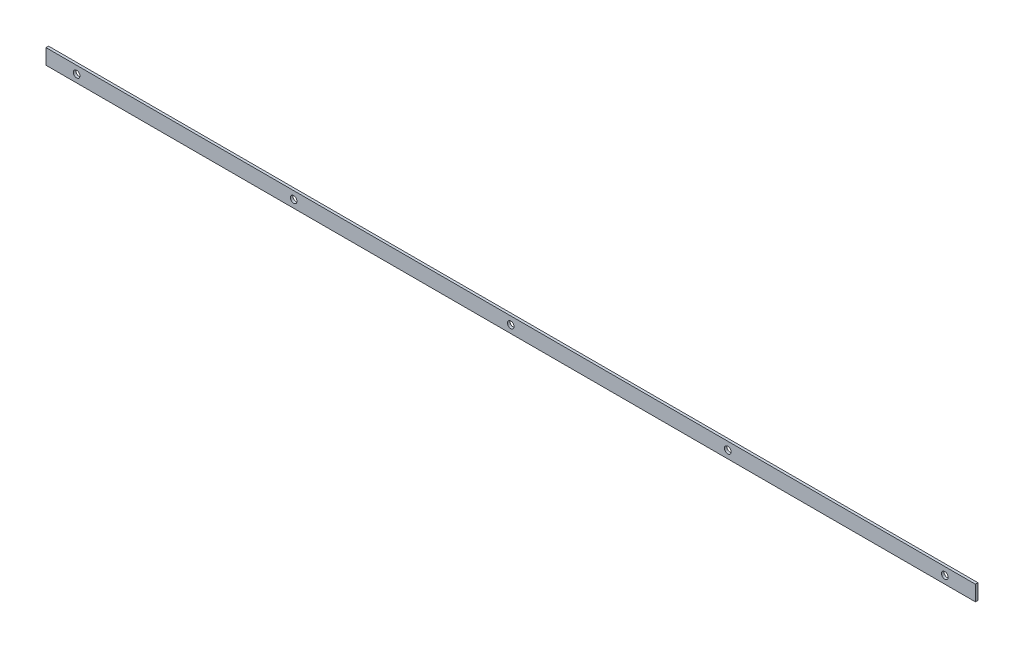
ISO-10303-21;
HEADER;
FILE_DESCRIPTION(('STEP AP214'),'2;1');
FILE_NAME('part.step','',(''),(''),'','','');
FILE_SCHEMA(('AUTOMOTIVE_DESIGN { 1 0 10303 214 1 1 1 1 }'));
ENDSEC;
DATA;
#1=APPLICATION_CONTEXT('core data for automotive mechanical design processes');
#2=APPLICATION_PROTOCOL_DEFINITION('international standard','automotive_design',2000,#1);
#3=PRODUCT_CONTEXT('',#1,'mechanical');
#4=PRODUCT('Part','Part','',(#3));
#5=PRODUCT_RELATED_PRODUCT_CATEGORY('part','',(#4));
#6=PRODUCT_DEFINITION_FORMATION('','',#4);
#7=PRODUCT_DEFINITION_CONTEXT('part definition',#1,'design');
#8=PRODUCT_DEFINITION('design','',#6,#7);
#9=PRODUCT_DEFINITION_SHAPE('','',#8);
#10=(LENGTH_UNIT() NAMED_UNIT(*) SI_UNIT(.MILLI.,.METRE.));
#11=(NAMED_UNIT(*) PLANE_ANGLE_UNIT() SI_UNIT($,.RADIAN.));
#12=(NAMED_UNIT(*) SI_UNIT($,.STERADIAN.) SOLID_ANGLE_UNIT());
#13=UNCERTAINTY_MEASURE_WITH_UNIT(LENGTH_MEASURE(1.E-05),#10,'distance_accuracy_value','');
#14=(GEOMETRIC_REPRESENTATION_CONTEXT(3) GLOBAL_UNCERTAINTY_ASSIGNED_CONTEXT((#13)) GLOBAL_UNIT_ASSIGNED_CONTEXT((#10,
#11,#12)) REPRESENTATION_CONTEXT('',''));
#15=CARTESIAN_POINT('',(0.,0.,0.));
#16=DIRECTION('',(0.,0.,1.));
#17=DIRECTION('',(1.,0.,0.));
#18=AXIS2_PLACEMENT_3D('',#15,#16,#17);
#19=CARTESIAN_POINT('',(850.,0.,-2.5));
#20=DIRECTION('',(0.,0.,-1.));
#21=DIRECTION('',(-1.,0.,0.));
#22=AXIS2_PLACEMENT_3D('',#19,#20,#21);
#23=CYLINDRICAL_SURFACE('',#22,6.49999999999995);
#24=CARTESIAN_POINT('',(850.,0.,2.5));
#25=DIRECTION('',(0.,0.,-1.));
#26=DIRECTION('',(-1.,0.,0.));
#27=AXIS2_PLACEMENT_3D('',#24,#25,#26);
#28=CIRCLE('',#27,6.49999999999995);
#29=CARTESIAN_POINT('',(843.5,0.,2.5));
#30=VERTEX_POINT('',#29);
#31=EDGE_CURVE('E57',#30,#30,#28,.T.);
#32=ORIENTED_EDGE('',*,*,#31,.F.);
#33=EDGE_LOOP('',(#32));
#34=FACE_BOUND('',#33,.T.);
#35=CARTESIAN_POINT('',(850.,0.,-2.5));
#36=DIRECTION('',(0.,0.,-1.));
#37=DIRECTION('',(-1.,0.,0.));
#38=AXIS2_PLACEMENT_3D('',#35,#36,#37);
#39=CIRCLE('',#38,6.49999999999995);
#40=CARTESIAN_POINT('',(843.5,0.,-2.5));
#41=VERTEX_POINT('',#40);
#42=EDGE_CURVE('E12',#41,#41,#39,.T.);
#43=ORIENTED_EDGE('',*,*,#42,.T.);
#44=EDGE_LOOP('',(#43));
#45=FACE_BOUND('',#44,.T.);
#46=ADVANCED_FACE('F49',(#34,#45),#23,.F.);
#47=CARTESIAN_POINT('',(425.,0.,-2.5));
#48=DIRECTION('',(0.,0.,-1.));
#49=DIRECTION('',(-1.,0.,0.));
#50=AXIS2_PLACEMENT_3D('',#47,#48,#49);
#51=CYLINDRICAL_SURFACE('',#50,6.49999999999995);
#52=CARTESIAN_POINT('',(425.,0.,2.5));
#53=DIRECTION('',(0.,0.,-1.));
#54=DIRECTION('',(-1.,0.,0.));
#55=AXIS2_PLACEMENT_3D('',#52,#53,#54);
#56=CIRCLE('',#55,6.49999999999995);
#57=CARTESIAN_POINT('',(418.5,0.,2.5));
#58=VERTEX_POINT('',#57);
#59=EDGE_CURVE('E133',#58,#58,#56,.T.);
#60=ORIENTED_EDGE('',*,*,#59,.F.);
#61=EDGE_LOOP('',(#60));
#62=FACE_BOUND('',#61,.T.);
#63=CARTESIAN_POINT('',(425.,0.,-2.5));
#64=DIRECTION('',(0.,0.,-1.));
#65=DIRECTION('',(-1.,0.,0.));
#66=AXIS2_PLACEMENT_3D('',#63,#64,#65);
#67=CIRCLE('',#66,6.49999999999995);
#68=CARTESIAN_POINT('',(418.5,0.,-2.5));
#69=VERTEX_POINT('',#68);
#70=EDGE_CURVE('E136',#69,#69,#67,.T.);
#71=ORIENTED_EDGE('',*,*,#70,.T.);
#72=EDGE_LOOP('',(#71));
#73=FACE_BOUND('',#72,.T.);
#74=ADVANCED_FACE('F145',(#62,#73),#51,.F.);
#75=CARTESIAN_POINT('',(0.,0.,-2.5));
#76=DIRECTION('',(0.,0.,-1.));
#77=DIRECTION('',(-1.,0.,0.));
#78=AXIS2_PLACEMENT_3D('',#75,#76,#77);
#79=CYLINDRICAL_SURFACE('',#78,6.49999999999995);
#80=CARTESIAN_POINT('',(0.,0.,2.5));
#81=DIRECTION('',(0.,0.,-1.));
#82=DIRECTION('',(-1.,0.,0.));
#83=AXIS2_PLACEMENT_3D('',#80,#81,#82);
#84=CIRCLE('',#83,6.49999999999995);
#85=CARTESIAN_POINT('',(-6.49999999999995,0.,2.5));
#86=VERTEX_POINT('',#85);
#87=EDGE_CURVE('E127',#86,#86,#84,.T.);
#88=ORIENTED_EDGE('',*,*,#87,.F.);
#89=EDGE_LOOP('',(#88));
#90=FACE_BOUND('',#89,.T.);
#91=CARTESIAN_POINT('',(0.,0.,-2.5));
#92=DIRECTION('',(0.,0.,-1.));
#93=DIRECTION('',(-1.,0.,0.));
#94=AXIS2_PLACEMENT_3D('',#91,#92,#93);
#95=CIRCLE('',#94,6.49999999999995);
#96=CARTESIAN_POINT('',(-6.49999999999995,0.,-2.5));
#97=VERTEX_POINT('',#96);
#98=EDGE_CURVE('E130',#97,#97,#95,.T.);
#99=ORIENTED_EDGE('',*,*,#98,.T.);
#100=EDGE_LOOP('',(#99));
#101=FACE_BOUND('',#100,.T.);
#102=ADVANCED_FACE('F157',(#90,#101),#79,.F.);
#103=CARTESIAN_POINT('',(910.,-15.,2.5));
#104=DIRECTION('',(0.,1.,0.));
#105=DIRECTION('',(0.,0.,1.));
#106=AXIS2_PLACEMENT_3D('',#103,#104,#105);
#107=PLANE('',#106);
#108=DIRECTION('',(0.,0.,-1.));
#109=VECTOR('',#108,1.);
#110=CARTESIAN_POINT('',(-910.,-15.,2.5));
#111=LINE('',#110,#109);
#112=CARTESIAN_POINT('',(-910.,-15.,2.5));
#113=VERTEX_POINT('',#112);
#114=CARTESIAN_POINT('',(-910.,-15.,-2.5));
#115=VERTEX_POINT('',#114);
#116=EDGE_CURVE('E117',#113,#115,#111,.T.);
#117=ORIENTED_EDGE('',*,*,#116,.T.);
#118=DIRECTION('',(-1.,0.,0.));
#119=VECTOR('',#118,1.);
#120=CARTESIAN_POINT('',(910.,-15.,-2.5));
#121=LINE('',#120,#119);
#122=CARTESIAN_POINT('',(910.,-15.,-2.5));
#123=VERTEX_POINT('',#122);
#124=EDGE_CURVE('E108',#123,#115,#121,.T.);
#125=ORIENTED_EDGE('',*,*,#124,.F.);
#126=DIRECTION('',(0.,0.,-1.));
#127=VECTOR('',#126,1.);
#128=CARTESIAN_POINT('',(910.,-15.,2.5));
#129=LINE('',#128,#127);
#130=CARTESIAN_POINT('',(910.,-15.,2.5));
#131=VERTEX_POINT('',#130);
#132=EDGE_CURVE('E101',#131,#123,#129,.T.);
#133=ORIENTED_EDGE('',*,*,#132,.F.);
#134=DIRECTION('',(-1.,0.,0.));
#135=VECTOR('',#134,1.);
#136=CARTESIAN_POINT('',(910.,-15.,2.5));
#137=LINE('',#136,#135);
#138=EDGE_CURVE('E113',#131,#113,#137,.T.);
#139=ORIENTED_EDGE('',*,*,#138,.T.);
#140=EDGE_LOOP('',(#117,#125,#133,#139));
#141=FACE_BOUND('',#140,.T.);
#142=ADVANCED_FACE('F149',(#141),#107,.F.);
#143=CARTESIAN_POINT('',(910.,-15.,-2.5));
#144=DIRECTION('',(0.,0.,1.));
#145=DIRECTION('',(1.,0.,0.));
#146=AXIS2_PLACEMENT_3D('',#143,#144,#145);
#147=PLANE('',#146);
#148=CARTESIAN_POINT('',(-425.,0.,-2.5));
#149=DIRECTION('',(0.,0.,-1.));
#150=DIRECTION('',(-1.,0.,0.));
#151=AXIS2_PLACEMENT_3D('',#148,#149,#150);
#152=CIRCLE('',#151,6.49999999999995);
#153=CARTESIAN_POINT('',(-431.5,0.,-2.5));
#154=VERTEX_POINT('',#153);
#155=EDGE_CURVE('E201',#154,#154,#152,.T.);
#156=ORIENTED_EDGE('',*,*,#155,.F.);
#157=EDGE_LOOP('',(#156));
#158=FACE_BOUND('',#157,.T.);
#159=CARTESIAN_POINT('',(-850.,0.,-2.5));
#160=DIRECTION('',(0.,0.,-1.));
#161=DIRECTION('',(-1.,0.,0.));
#162=AXIS2_PLACEMENT_3D('',#159,#160,#161);
#163=CIRCLE('',#162,6.49999999999995);
#164=CARTESIAN_POINT('',(-856.5,0.,-2.5));
#165=VERTEX_POINT('',#164);
#166=EDGE_CURVE('E202',#165,#165,#163,.T.);
#167=ORIENTED_EDGE('',*,*,#166,.F.);
#168=EDGE_LOOP('',(#167));
#169=FACE_BOUND('',#168,.T.);
#170=DIRECTION('',(0.,1.,0.));
#171=VECTOR('',#170,1.);
#172=CARTESIAN_POINT('',(-910.,-15.,-2.5));
#173=LINE('',#172,#171);
#174=CARTESIAN_POINT('',(-910.,15.,-2.5));
#175=VERTEX_POINT('',#174);
#176=EDGE_CURVE('E107',#115,#175,#173,.T.);
#177=ORIENTED_EDGE('',*,*,#176,.T.);
#178=DIRECTION('',(-1.,0.,0.));
#179=VECTOR('',#178,1.);
#180=CARTESIAN_POINT('',(910.,15.,-2.5));
#181=LINE('',#180,#179);
#182=CARTESIAN_POINT('',(910.,15.,-2.5));
#183=VERTEX_POINT('',#182);
#184=EDGE_CURVE('E104',#183,#175,#181,.T.);
#185=ORIENTED_EDGE('',*,*,#184,.F.);
#186=DIRECTION('',(0.,1.,0.));
#187=VECTOR('',#186,1.);
#188=CARTESIAN_POINT('',(910.,-15.,-2.5));
#189=LINE('',#188,#187);
#190=EDGE_CURVE('E96',#123,#183,#189,.T.);
#191=ORIENTED_EDGE('',*,*,#190,.F.);
#192=ORIENTED_EDGE('',*,*,#124,.T.);
#193=EDGE_LOOP('',(#177,#185,#191,#192));
#194=FACE_BOUND('',#193,.T.);
#195=ORIENTED_EDGE('',*,*,#98,.F.);
#196=EDGE_LOOP('',(#195));
#197=FACE_BOUND('',#196,.T.);
#198=ORIENTED_EDGE('',*,*,#70,.F.);
#199=EDGE_LOOP('',(#198));
#200=FACE_BOUND('',#199,.T.);
#201=ORIENTED_EDGE('',*,*,#42,.F.);
#202=EDGE_LOOP('',(#201));
#203=FACE_BOUND('',#202,.T.);
#204=ADVANCED_FACE('F105',(#158,#169,#194,#197,#200,#203),#147,.F.);
#205=CARTESIAN_POINT('',(910.,15.,2.5));
#206=DIRECTION('',(0.,-1.,0.));
#207=DIRECTION('',(0.,0.,-1.));
#208=AXIS2_PLACEMENT_3D('',#205,#206,#207);
#209=PLANE('',#208);
#210=DIRECTION('',(0.,0.,1.));
#211=VECTOR('',#210,1.);
#212=CARTESIAN_POINT('',(-910.,15.,2.5));
#213=LINE('',#212,#211);
#214=CARTESIAN_POINT('',(-910.,15.,2.5));
#215=VERTEX_POINT('',#214);
#216=EDGE_CURVE('E82',#175,#215,#213,.T.);
#217=ORIENTED_EDGE('',*,*,#216,.T.);
#218=DIRECTION('',(-1.,0.,0.));
#219=VECTOR('',#218,1.);
#220=CARTESIAN_POINT('',(910.,15.,2.5));
#221=LINE('',#220,#219);
#222=CARTESIAN_POINT('',(910.,15.,2.5));
#223=VERTEX_POINT('',#222);
#224=EDGE_CURVE('E109',#223,#215,#221,.T.);
#225=ORIENTED_EDGE('',*,*,#224,.F.);
#226=DIRECTION('',(0.,0.,1.));
#227=VECTOR('',#226,1.);
#228=CARTESIAN_POINT('',(910.,15.,2.5));
#229=LINE('',#228,#227);
#230=EDGE_CURVE('E99',#183,#223,#229,.T.);
#231=ORIENTED_EDGE('',*,*,#230,.F.);
#232=ORIENTED_EDGE('',*,*,#184,.T.);
#233=EDGE_LOOP('',(#217,#225,#231,#232));
#234=FACE_BOUND('',#233,.T.);
#235=ADVANCED_FACE('F111',(#234),#209,.F.);
#236=CARTESIAN_POINT('',(910.,-15.,2.5));
#237=DIRECTION('',(0.,0.,-1.));
#238=DIRECTION('',(-1.,0.,0.));
#239=AXIS2_PLACEMENT_3D('',#236,#237,#238);
#240=PLANE('',#239);
#241=CARTESIAN_POINT('',(-425.,0.,2.5));
#242=DIRECTION('',(0.,0.,-1.));
#243=DIRECTION('',(-1.,0.,0.));
#244=AXIS2_PLACEMENT_3D('',#241,#242,#243);
#245=CIRCLE('',#244,6.49999999999995);
#246=CARTESIAN_POINT('',(-431.5,0.,2.5));
#247=VERTEX_POINT('',#246);
#248=EDGE_CURVE('E199',#247,#247,#245,.T.);
#249=ORIENTED_EDGE('',*,*,#248,.T.);
#250=EDGE_LOOP('',(#249));
#251=FACE_BOUND('',#250,.T.);
#252=CARTESIAN_POINT('',(-850.,0.,2.5));
#253=DIRECTION('',(0.,0.,-1.));
#254=DIRECTION('',(-1.,0.,0.));
#255=AXIS2_PLACEMENT_3D('',#252,#253,#254);
#256=CIRCLE('',#255,6.49999999999995);
#257=CARTESIAN_POINT('',(-856.5,0.,2.5));
#258=VERTEX_POINT('',#257);
#259=EDGE_CURVE('E120',#258,#258,#256,.T.);
#260=ORIENTED_EDGE('',*,*,#259,.T.);
#261=EDGE_LOOP('',(#260));
#262=FACE_BOUND('',#261,.T.);
#263=DIRECTION('',(0.,-1.,0.));
#264=VECTOR('',#263,1.);
#265=CARTESIAN_POINT('',(-910.,-15.,2.5));
#266=LINE('',#265,#264);
#267=EDGE_CURVE('E88',#215,#113,#266,.T.);
#268=ORIENTED_EDGE('',*,*,#267,.T.);
#269=ORIENTED_EDGE('',*,*,#138,.F.);
#270=DIRECTION('',(0.,-1.,0.));
#271=VECTOR('',#270,1.);
#272=CARTESIAN_POINT('',(910.,-15.,2.5));
#273=LINE('',#272,#271);
#274=EDGE_CURVE('E65',#223,#131,#273,.T.);
#275=ORIENTED_EDGE('',*,*,#274,.F.);
#276=ORIENTED_EDGE('',*,*,#224,.T.);
#277=EDGE_LOOP('',(#268,#269,#275,#276));
#278=FACE_BOUND('',#277,.T.);
#279=ORIENTED_EDGE('',*,*,#87,.T.);
#280=EDGE_LOOP('',(#279));
#281=FACE_BOUND('',#280,.T.);
#282=ORIENTED_EDGE('',*,*,#59,.T.);
#283=EDGE_LOOP('',(#282));
#284=FACE_BOUND('',#283,.T.);
#285=ORIENTED_EDGE('',*,*,#31,.T.);
#286=EDGE_LOOP('',(#285));
#287=FACE_BOUND('',#286,.T.);
#288=ADVANCED_FACE('F141',(#251,#262,#278,#281,#284,#287),#240,.F.);
#289=CARTESIAN_POINT('',(910.,-15.,-2.5));
#290=DIRECTION('',(1.,0.,0.));
#291=DIRECTION('',(0.,0.,-1.));
#292=AXIS2_PLACEMENT_3D('',#289,#290,#291);
#293=PLANE('',#292);
#294=ORIENTED_EDGE('',*,*,#132,.T.);
#295=ORIENTED_EDGE('',*,*,#190,.T.);
#296=ORIENTED_EDGE('',*,*,#230,.T.);
#297=ORIENTED_EDGE('',*,*,#274,.T.);
#298=EDGE_LOOP('',(#294,#295,#296,#297));
#299=FACE_BOUND('',#298,.T.);
#300=ADVANCED_FACE('F97',(#299),#293,.T.);
#301=CARTESIAN_POINT('',(-910.,-15.,-2.5));
#302=DIRECTION('',(1.,0.,0.));
#303=DIRECTION('',(0.,0.,-1.));
#304=AXIS2_PLACEMENT_3D('',#301,#302,#303);
#305=PLANE('',#304);
#306=ORIENTED_EDGE('',*,*,#116,.F.);
#307=ORIENTED_EDGE('',*,*,#267,.F.);
#308=ORIENTED_EDGE('',*,*,#216,.F.);
#309=ORIENTED_EDGE('',*,*,#176,.F.);
#310=EDGE_LOOP('',(#306,#307,#308,#309));
#311=FACE_BOUND('',#310,.T.);
#312=ADVANCED_FACE('F180',(#311),#305,.F.);
#313=CARTESIAN_POINT('',(-850.,0.,-2.5));
#314=DIRECTION('',(0.,0.,-1.));
#315=DIRECTION('',(-1.,0.,0.));
#316=AXIS2_PLACEMENT_3D('',#313,#314,#315);
#317=CYLINDRICAL_SURFACE('',#316,6.49999999999995);
#318=ORIENTED_EDGE('',*,*,#259,.F.);
#319=EDGE_LOOP('',(#318));
#320=FACE_BOUND('',#319,.T.);
#321=ORIENTED_EDGE('',*,*,#166,.T.);
#322=EDGE_LOOP('',(#321));
#323=FACE_BOUND('',#322,.T.);
#324=ADVANCED_FACE('F186',(#320,#323),#317,.F.);
#325=CARTESIAN_POINT('',(-425.,0.,-2.5));
#326=DIRECTION('',(0.,0.,-1.));
#327=DIRECTION('',(-1.,0.,0.));
#328=AXIS2_PLACEMENT_3D('',#325,#326,#327);
#329=CYLINDRICAL_SURFACE('',#328,6.49999999999995);
#330=ORIENTED_EDGE('',*,*,#248,.F.);
#331=EDGE_LOOP('',(#330));
#332=FACE_BOUND('',#331,.T.);
#333=ORIENTED_EDGE('',*,*,#155,.T.);
#334=EDGE_LOOP('',(#333));
#335=FACE_BOUND('',#334,.T.);
#336=ADVANCED_FACE('F191',(#332,#335),#329,.F.);
#337=CLOSED_SHELL('',(#46,#74,#102,#142,#204,#235,#288,#300,#312,#324,#336));
#338=MANIFOLD_SOLID_BREP('B2',#337);
#339=ADVANCED_BREP_SHAPE_REPRESENTATION('',(#18,#338),#14);
#340=SHAPE_DEFINITION_REPRESENTATION(#9,#339);
ENDSEC;
END-ISO-10303-21;
